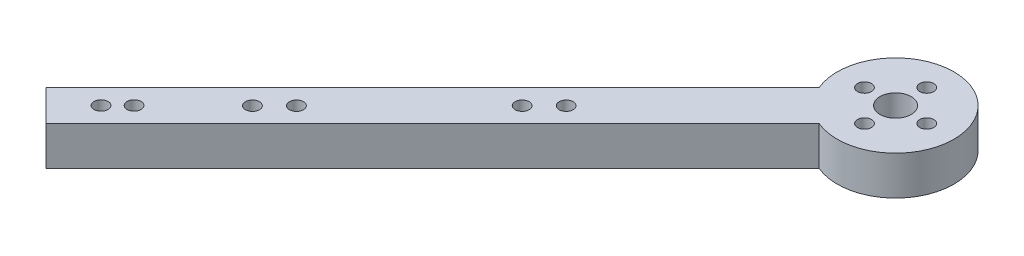
ISO-10303-21;
HEADER;
FILE_DESCRIPTION(('STEP AP214'),'2;1');
FILE_NAME('part.step','',(''),(''),'','','');
FILE_SCHEMA(('AUTOMOTIVE_DESIGN { 1 0 10303 214 1 1 1 1 }'));
ENDSEC;
DATA;
#1=APPLICATION_CONTEXT('core data for automotive mechanical design processes');
#2=APPLICATION_PROTOCOL_DEFINITION('international standard','automotive_design',2000,#1);
#3=PRODUCT_CONTEXT('',#1,'mechanical');
#4=PRODUCT('Part','Part','',(#3));
#5=PRODUCT_RELATED_PRODUCT_CATEGORY('part','',(#4));
#6=PRODUCT_DEFINITION_FORMATION('','',#4);
#7=PRODUCT_DEFINITION_CONTEXT('part definition',#1,'design');
#8=PRODUCT_DEFINITION('design','',#6,#7);
#9=PRODUCT_DEFINITION_SHAPE('','',#8);
#10=(LENGTH_UNIT() NAMED_UNIT(*) SI_UNIT(.MILLI.,.METRE.));
#11=(NAMED_UNIT(*) PLANE_ANGLE_UNIT() SI_UNIT($,.RADIAN.));
#12=(NAMED_UNIT(*) SI_UNIT($,.STERADIAN.) SOLID_ANGLE_UNIT());
#13=UNCERTAINTY_MEASURE_WITH_UNIT(LENGTH_MEASURE(1.E-05),#10,'distance_accuracy_value','');
#14=(GEOMETRIC_REPRESENTATION_CONTEXT(3) GLOBAL_UNCERTAINTY_ASSIGNED_CONTEXT((#13)) GLOBAL_UNIT_ASSIGNED_CONTEXT((#10,
#11,#12)) REPRESENTATION_CONTEXT('',''));
#15=CARTESIAN_POINT('',(0.,0.,0.));
#16=DIRECTION('',(0.,0.,1.));
#17=DIRECTION('',(1.,0.,0.));
#18=AXIS2_PLACEMENT_3D('',#15,#16,#17);
#19=CARTESIAN_POINT('',(0.,6.35,0.));
#20=DIRECTION('',(0.,-1.,0.));
#21=DIRECTION('',(0.,0.,-1.));
#22=AXIS2_PLACEMENT_3D('',#19,#20,#21);
#23=CYLINDRICAL_SURFACE('',#22,9.525);
#24=DIRECTION('',(0.,-1.,0.));
#25=VECTOR('',#24,1.);
#26=CARTESIAN_POINT('',(-8.77788525864336,6.35,3.69788525864331));
#27=LINE('',#26,#25);
#28=CARTESIAN_POINT('',(-8.77788525864337,6.35,3.69788525864331));
#29=VERTEX_POINT('',#28);
#30=CARTESIAN_POINT('',(-8.77788525864337,0.,3.69788525864331));
#31=VERTEX_POINT('',#30);
#32=EDGE_CURVE('E98',#29,#31,#27,.T.);
#33=ORIENTED_EDGE('',*,*,#32,.F.);
#34=CARTESIAN_POINT('',(0.,6.35,0.));
#35=DIRECTION('',(0.,1.,0.));
#36=DIRECTION('',(0.,0.,1.));
#37=AXIS2_PLACEMENT_3D('',#34,#35,#36);
#38=CIRCLE('',#37,9.525);
#39=CARTESIAN_POINT('',(-3.69788525864339,6.35,8.77788525864333));
#40=VERTEX_POINT('',#39);
#41=EDGE_CURVE('E11',#40,#29,#38,.T.);
#42=ORIENTED_EDGE('',*,*,#41,.F.);
#43=DIRECTION('',(0.,-1.,0.));
#44=VECTOR('',#43,1.);
#45=CARTESIAN_POINT('',(-3.69788525864339,6.35,8.77788525864333));
#46=LINE('',#45,#44);
#47=CARTESIAN_POINT('',(-3.69788525864339,0.,8.77788525864333));
#48=VERTEX_POINT('',#47);
#49=EDGE_CURVE('E107',#40,#48,#46,.T.);
#50=ORIENTED_EDGE('',*,*,#49,.T.);
#51=CARTESIAN_POINT('',(0.,0.,0.));
#52=DIRECTION('',(0.,1.,0.));
#53=DIRECTION('',(0.,0.,1.));
#54=AXIS2_PLACEMENT_3D('',#51,#52,#53);
#55=CIRCLE('',#54,9.525);
#56=EDGE_CURVE('E44',#48,#31,#55,.T.);
#57=ORIENTED_EDGE('',*,*,#56,.T.);
#58=EDGE_LOOP('',(#33,#42,#50,#57));
#59=FACE_BOUND('',#58,.T.);
#60=ADVANCED_FACE('F41',(#59),#23,.T.);
#61=CARTESIAN_POINT('',(0.,6.35,0.));
#62=DIRECTION('',(0.,1.,0.));
#63=DIRECTION('',(0.,0.,1.));
#64=AXIS2_PLACEMENT_3D('',#61,#62,#63);
#65=PLANE('',#64);
#66=CARTESIAN_POINT('',(-64.8210295257706,6.35,64.8028122902666));
#67=DIRECTION('',(0.,1.,0.));
#68=DIRECTION('',(0.,0.,1.));
#69=AXIS2_PLACEMENT_3D('',#66,#67,#68);
#70=CIRCLE('',#69,1.14300000000001);
#71=CARTESIAN_POINT('',(-64.8210295257706,6.35,65.9458122902666));
#72=VERTEX_POINT('',#71);
#73=EDGE_CURVE('E333',#72,#72,#70,.T.);
#74=ORIENTED_EDGE('',*,*,#73,.F.);
#75=EDGE_LOOP('',(#74));
#76=FACE_BOUND('',#75,.T.);
#77=CARTESIAN_POINT('',(-62.1269526894493,6.35,62.1087354539465));
#78=DIRECTION('',(0.,1.,0.));
#79=DIRECTION('',(0.,0.,1.));
#80=AXIS2_PLACEMENT_3D('',#77,#78,#79);
#81=CIRCLE('',#80,1.14299999999959);
#82=CARTESIAN_POINT('',(-62.1269526894493,6.35,63.2517354539461));
#83=VERTEX_POINT('',#82);
#84=EDGE_CURVE('E341',#83,#83,#81,.T.);
#85=ORIENTED_EDGE('',*,*,#84,.F.);
#86=EDGE_LOOP('',(#85));
#87=FACE_BOUND('',#86,.T.);
#88=CARTESIAN_POINT('',(-52.4386025927429,6.35,52.4896591649441));
#89=DIRECTION('',(0.,1.,0.));
#90=DIRECTION('',(0.,0.,1.));
#91=AXIS2_PLACEMENT_3D('',#88,#89,#90);
#92=CIRCLE('',#91,1.143);
#93=CARTESIAN_POINT('',(-52.4386025927429,6.35,53.6326591649441));
#94=VERTEX_POINT('',#93);
#95=EDGE_CURVE('E351',#94,#94,#92,.T.);
#96=ORIENTED_EDGE('',*,*,#95,.F.);
#97=EDGE_LOOP('',(#96));
#98=FACE_BOUND('',#97,.T.);
#99=CARTESIAN_POINT('',(-48.8465001443152,6.35,48.8975567165164));
#100=DIRECTION('',(0.,1.,0.));
#101=DIRECTION('',(0.,0.,1.));
#102=AXIS2_PLACEMENT_3D('',#99,#100,#101);
#103=CIRCLE('',#102,1.143);
#104=CARTESIAN_POINT('',(-48.8465001443152,6.35,50.0405567165164));
#105=VERTEX_POINT('',#104);
#106=EDGE_CURVE('E359',#105,#105,#103,.T.);
#107=ORIENTED_EDGE('',*,*,#106,.F.);
#108=EDGE_LOOP('',(#107));
#109=FACE_BOUND('',#108,.T.);
#110=CARTESIAN_POINT('',(-30.4369750961234,6.35,30.4880316683247));
#111=DIRECTION('',(0.,1.,0.));
#112=DIRECTION('',(0.,0.,1.));
#113=AXIS2_PLACEMENT_3D('',#110,#111,#112);
#114=CIRCLE('',#113,1.143);
#115=CARTESIAN_POINT('',(-30.4369750961234,6.35,31.6310316683247));
#116=VERTEX_POINT('',#115);
#117=EDGE_CURVE('E367',#116,#116,#114,.T.);
#118=ORIENTED_EDGE('',*,*,#117,.F.);
#119=EDGE_LOOP('',(#118));
#120=FACE_BOUND('',#119,.T.);
#121=CARTESIAN_POINT('',(-26.8448726476958,6.35,26.895929219897));
#122=DIRECTION('',(0.,1.,0.));
#123=DIRECTION('',(0.,0.,1.));
#124=AXIS2_PLACEMENT_3D('',#121,#122,#123);
#125=CIRCLE('',#124,1.143);
#126=CARTESIAN_POINT('',(-26.8448726476958,6.35,28.038929219897));
#127=VERTEX_POINT('',#126);
#128=EDGE_CURVE('E374',#127,#127,#125,.T.);
#129=ORIENTED_EDGE('',*,*,#128,.F.);
#130=EDGE_LOOP('',(#129));
#131=FACE_BOUND('',#130,.T.);
#132=CARTESIAN_POINT('',(5.08,6.35,0.));
#133=DIRECTION('',(0.,1.,0.));
#134=DIRECTION('',(0.,0.,1.));
#135=AXIS2_PLACEMENT_3D('',#132,#133,#134);
#136=CIRCLE('',#135,1.143);
#137=CARTESIAN_POINT('',(5.08,6.35,1.14300000000004));
#138=VERTEX_POINT('',#137);
#139=EDGE_CURVE('E135',#138,#138,#136,.T.);
#140=ORIENTED_EDGE('',*,*,#139,.F.);
#141=EDGE_LOOP('',(#140));
#142=FACE_BOUND('',#141,.T.);
#143=CARTESIAN_POINT('',(-5.08,6.35,0.));
#144=DIRECTION('',(0.,1.,0.));
#145=DIRECTION('',(0.,0.,1.));
#146=AXIS2_PLACEMENT_3D('',#143,#144,#145);
#147=CIRCLE('',#146,1.143);
#148=CARTESIAN_POINT('',(-5.08,6.35,1.143));
#149=VERTEX_POINT('',#148);
#150=EDGE_CURVE('E151',#149,#149,#147,.T.);
#151=ORIENTED_EDGE('',*,*,#150,.F.);
#152=EDGE_LOOP('',(#151));
#153=FACE_BOUND('',#152,.T.);
#154=ORIENTED_EDGE('',*,*,#41,.T.);
#155=DIRECTION('',(-0.70710678118655,0.,0.707106781186545));
#156=VECTOR('',#155,1.);
#157=CARTESIAN_POINT('',(-2.53999999999999,6.35,-2.54000000000001));
#158=LINE('',#157,#156);
#159=CARTESIAN_POINT('',(-71.8420489685535,6.35,66.7620489685529));
#160=VERTEX_POINT('',#159);
#161=EDGE_CURVE('E77',#29,#160,#158,.T.);
#162=ORIENTED_EDGE('',*,*,#161,.T.);
#163=DIRECTION('',(0.707106781186547,0.,0.707106781186549));
#164=VECTOR('',#163,1.);
#165=CARTESIAN_POINT('',(-69.3020489685533,6.35,69.3020489685532));
#166=LINE('',#165,#164);
#167=CARTESIAN_POINT('',(-66.7620489685536,6.35,71.8420489685529));
#168=VERTEX_POINT('',#167);
#169=EDGE_CURVE('E83',#160,#168,#166,.T.);
#170=ORIENTED_EDGE('',*,*,#169,.T.);
#171=DIRECTION('',(-0.707106781186551,0.,0.707106781186544));
#172=VECTOR('',#171,1.);
#173=CARTESIAN_POINT('',(2.53999999999999,6.35,2.54000000000002));
#174=LINE('',#173,#172);
#175=EDGE_CURVE('E104',#40,#168,#174,.T.);
#176=ORIENTED_EDGE('',*,*,#175,.F.);
#177=EDGE_LOOP('',(#154,#162,#170,#176));
#178=FACE_BOUND('',#177,.T.);
#179=CARTESIAN_POINT('',(0.,6.35,0.));
#180=DIRECTION('',(0.,1.,0.));
#181=DIRECTION('',(0.,0.,1.));
#182=AXIS2_PLACEMENT_3D('',#179,#180,#181);
#183=CIRCLE('',#182,2.54);
#184=CARTESIAN_POINT('',(0.,6.35,2.54));
#185=VERTEX_POINT('',#184);
#186=EDGE_CURVE('E159',#185,#185,#183,.T.);
#187=ORIENTED_EDGE('',*,*,#186,.F.);
#188=EDGE_LOOP('',(#187));
#189=FACE_BOUND('',#188,.T.);
#190=CARTESIAN_POINT('',(0.,6.35,-5.08));
#191=DIRECTION('',(0.,1.,0.));
#192=DIRECTION('',(0.,0.,1.));
#193=AXIS2_PLACEMENT_3D('',#190,#191,#192);
#194=CIRCLE('',#193,1.143);
#195=CARTESIAN_POINT('',(0.,6.35,-3.937));
#196=VERTEX_POINT('',#195);
#197=EDGE_CURVE('E143',#196,#196,#194,.T.);
#198=ORIENTED_EDGE('',*,*,#197,.F.);
#199=EDGE_LOOP('',(#198));
#200=FACE_BOUND('',#199,.T.);
#201=CARTESIAN_POINT('',(0.,6.35,5.08));
#202=DIRECTION('',(0.,1.,0.));
#203=DIRECTION('',(0.,0.,1.));
#204=AXIS2_PLACEMENT_3D('',#201,#202,#203);
#205=CIRCLE('',#204,1.143);
#206=CARTESIAN_POINT('',(0.,6.35,6.223));
#207=VERTEX_POINT('',#206);
#208=EDGE_CURVE('E127',#207,#207,#205,.T.);
#209=ORIENTED_EDGE('',*,*,#208,.F.);
#210=EDGE_LOOP('',(#209));
#211=FACE_BOUND('',#210,.T.);
#212=ADVANCED_FACE('F79',(#76,#87,#98,#109,#120,#131,#142,#153,#178,#189,#200,#211),#65,.T.);
#213=CARTESIAN_POINT('',(0.,0.,0.));
#214=DIRECTION('',(0.,1.,0.));
#215=DIRECTION('',(0.,0.,1.));
#216=AXIS2_PLACEMENT_3D('',#213,#214,#215);
#217=PLANE('',#216);
#218=CARTESIAN_POINT('',(-64.8210295257706,0.,64.8028122902666));
#219=DIRECTION('',(0.,1.,0.));
#220=DIRECTION('',(0.,0.,1.));
#221=AXIS2_PLACEMENT_3D('',#218,#219,#220);
#222=CIRCLE('',#221,1.14300000000001);
#223=CARTESIAN_POINT('',(-64.8210295257706,0.,65.9458122902666));
#224=VERTEX_POINT('',#223);
#225=EDGE_CURVE('E114',#224,#224,#222,.T.);
#226=ORIENTED_EDGE('',*,*,#225,.T.);
#227=EDGE_LOOP('',(#226));
#228=FACE_BOUND('',#227,.T.);
#229=CARTESIAN_POINT('',(-62.1269526894493,0.,62.1087354539465));
#230=DIRECTION('',(0.,1.,0.));
#231=DIRECTION('',(0.,0.,1.));
#232=AXIS2_PLACEMENT_3D('',#229,#230,#231);
#233=CIRCLE('',#232,1.14299999999959);
#234=CARTESIAN_POINT('',(-62.1269526894493,0.,63.2517354539461));
#235=VERTEX_POINT('',#234);
#236=EDGE_CURVE('E335',#235,#235,#233,.T.);
#237=ORIENTED_EDGE('',*,*,#236,.T.);
#238=EDGE_LOOP('',(#237));
#239=FACE_BOUND('',#238,.T.);
#240=CARTESIAN_POINT('',(-52.4386025927429,0.,52.4896591649441));
#241=DIRECTION('',(0.,1.,0.));
#242=DIRECTION('',(0.,0.,1.));
#243=AXIS2_PLACEMENT_3D('',#240,#241,#242);
#244=CIRCLE('',#243,1.143);
#245=CARTESIAN_POINT('',(-52.4386025927429,0.,53.6326591649441));
#246=VERTEX_POINT('',#245);
#247=EDGE_CURVE('E347',#246,#246,#244,.T.);
#248=ORIENTED_EDGE('',*,*,#247,.T.);
#249=EDGE_LOOP('',(#248));
#250=FACE_BOUND('',#249,.T.);
#251=CARTESIAN_POINT('',(-48.8465001443152,0.,48.8975567165164));
#252=DIRECTION('',(0.,1.,0.));
#253=DIRECTION('',(0.,0.,1.));
#254=AXIS2_PLACEMENT_3D('',#251,#252,#253);
#255=CIRCLE('',#254,1.143);
#256=CARTESIAN_POINT('',(-48.8465001443152,0.,50.0405567165164));
#257=VERTEX_POINT('',#256);
#258=EDGE_CURVE('E355',#257,#257,#255,.T.);
#259=ORIENTED_EDGE('',*,*,#258,.T.);
#260=EDGE_LOOP('',(#259));
#261=FACE_BOUND('',#260,.T.);
#262=CARTESIAN_POINT('',(-30.4369750961234,0.,30.4880316683247));
#263=DIRECTION('',(0.,1.,0.));
#264=DIRECTION('',(0.,0.,1.));
#265=AXIS2_PLACEMENT_3D('',#262,#263,#264);
#266=CIRCLE('',#265,1.143);
#267=CARTESIAN_POINT('',(-30.4369750961234,0.,31.6310316683247));
#268=VERTEX_POINT('',#267);
#269=EDGE_CURVE('E363',#268,#268,#266,.T.);
#270=ORIENTED_EDGE('',*,*,#269,.T.);
#271=EDGE_LOOP('',(#270));
#272=FACE_BOUND('',#271,.T.);
#273=CARTESIAN_POINT('',(-26.8448726476958,0.,26.895929219897));
#274=DIRECTION('',(0.,1.,0.));
#275=DIRECTION('',(0.,0.,1.));
#276=AXIS2_PLACEMENT_3D('',#273,#274,#275);
#277=CIRCLE('',#276,1.143);
#278=CARTESIAN_POINT('',(-26.8448726476958,0.,28.038929219897));
#279=VERTEX_POINT('',#278);
#280=EDGE_CURVE('E371',#279,#279,#277,.T.);
#281=ORIENTED_EDGE('',*,*,#280,.T.);
#282=EDGE_LOOP('',(#281));
#283=FACE_BOUND('',#282,.T.);
#284=ORIENTED_EDGE('',*,*,#56,.F.);
#285=DIRECTION('',(-0.707106781186551,0.,0.707106781186544));
#286=VECTOR('',#285,1.);
#287=CARTESIAN_POINT('',(2.53999999999999,0.,2.54000000000002));
#288=LINE('',#287,#286);
#289=CARTESIAN_POINT('',(-66.7620489685536,0.,71.8420489685529));
#290=VERTEX_POINT('',#289);
#291=EDGE_CURVE('E87',#48,#290,#288,.T.);
#292=ORIENTED_EDGE('',*,*,#291,.T.);
#293=DIRECTION('',(0.707106781186547,0.,0.707106781186549));
#294=VECTOR('',#293,1.);
#295=CARTESIAN_POINT('',(-69.3020489685533,0.,69.3020489685532));
#296=LINE('',#295,#294);
#297=CARTESIAN_POINT('',(-71.8420489685535,0.,66.7620489685529));
#298=VERTEX_POINT('',#297);
#299=EDGE_CURVE('E113',#298,#290,#296,.T.);
#300=ORIENTED_EDGE('',*,*,#299,.F.);
#301=DIRECTION('',(-0.70710678118655,0.,0.707106781186545));
#302=VECTOR('',#301,1.);
#303=CARTESIAN_POINT('',(-2.53999999999999,0.,-2.54000000000001));
#304=LINE('',#303,#302);
#305=EDGE_CURVE('E93',#31,#298,#304,.T.);
#306=ORIENTED_EDGE('',*,*,#305,.F.);
#307=EDGE_LOOP('',(#284,#292,#300,#306));
#308=FACE_BOUND('',#307,.T.);
#309=CARTESIAN_POINT('',(0.,0.,0.));
#310=DIRECTION('',(0.,1.,0.));
#311=DIRECTION('',(0.,0.,1.));
#312=AXIS2_PLACEMENT_3D('',#309,#310,#311);
#313=CIRCLE('',#312,2.54);
#314=CARTESIAN_POINT('',(0.,0.,2.54));
#315=VERTEX_POINT('',#314);
#316=EDGE_CURVE('E155',#315,#315,#313,.T.);
#317=ORIENTED_EDGE('',*,*,#316,.T.);
#318=EDGE_LOOP('',(#317));
#319=FACE_BOUND('',#318,.T.);
#320=CARTESIAN_POINT('',(-5.08,0.,0.));
#321=DIRECTION('',(0.,1.,0.));
#322=DIRECTION('',(0.,0.,1.));
#323=AXIS2_PLACEMENT_3D('',#320,#321,#322);
#324=CIRCLE('',#323,1.143);
#325=CARTESIAN_POINT('',(-5.08,0.,1.143));
#326=VERTEX_POINT('',#325);
#327=EDGE_CURVE('E147',#326,#326,#324,.T.);
#328=ORIENTED_EDGE('',*,*,#327,.T.);
#329=EDGE_LOOP('',(#328));
#330=FACE_BOUND('',#329,.T.);
#331=CARTESIAN_POINT('',(0.,0.,-5.08));
#332=DIRECTION('',(0.,1.,0.));
#333=DIRECTION('',(0.,0.,1.));
#334=AXIS2_PLACEMENT_3D('',#331,#332,#333);
#335=CIRCLE('',#334,1.143);
#336=CARTESIAN_POINT('',(0.,0.,-3.937));
#337=VERTEX_POINT('',#336);
#338=EDGE_CURVE('E139',#337,#337,#335,.T.);
#339=ORIENTED_EDGE('',*,*,#338,.T.);
#340=EDGE_LOOP('',(#339));
#341=FACE_BOUND('',#340,.T.);
#342=CARTESIAN_POINT('',(5.08,0.,0.));
#343=DIRECTION('',(0.,1.,0.));
#344=DIRECTION('',(0.,0.,1.));
#345=AXIS2_PLACEMENT_3D('',#342,#343,#344);
#346=CIRCLE('',#345,1.143);
#347=CARTESIAN_POINT('',(5.08,0.,1.14300000000004));
#348=VERTEX_POINT('',#347);
#349=EDGE_CURVE('E131',#348,#348,#346,.T.);
#350=ORIENTED_EDGE('',*,*,#349,.T.);
#351=EDGE_LOOP('',(#350));
#352=FACE_BOUND('',#351,.T.);
#353=CARTESIAN_POINT('',(0.,0.,5.08));
#354=DIRECTION('',(0.,1.,0.));
#355=DIRECTION('',(0.,0.,1.));
#356=AXIS2_PLACEMENT_3D('',#353,#354,#355);
#357=CIRCLE('',#356,1.143);
#358=CARTESIAN_POINT('',(0.,0.,6.223));
#359=VERTEX_POINT('',#358);
#360=EDGE_CURVE('E126',#359,#359,#357,.T.);
#361=ORIENTED_EDGE('',*,*,#360,.T.);
#362=EDGE_LOOP('',(#361));
#363=FACE_BOUND('',#362,.T.);
#364=ADVANCED_FACE('F167',(#228,#239,#250,#261,#272,#283,#308,#319,#330,#341,#352,#363),#217,.F.);
#365=CARTESIAN_POINT('',(0.,6.35,0.));
#366=DIRECTION('',(0.,-1.,0.));
#367=DIRECTION('',(0.,0.,-1.));
#368=AXIS2_PLACEMENT_3D('',#365,#366,#367);
#369=CYLINDRICAL_SURFACE('',#368,2.54);
#370=ORIENTED_EDGE('',*,*,#186,.T.);
#371=EDGE_LOOP('',(#370));
#372=FACE_BOUND('',#371,.T.);
#373=ORIENTED_EDGE('',*,*,#316,.F.);
#374=EDGE_LOOP('',(#373));
#375=FACE_BOUND('',#374,.T.);
#376=ADVANCED_FACE('F170',(#372,#375),#369,.F.);
#377=CARTESIAN_POINT('',(-5.08,6.35,0.));
#378=DIRECTION('',(0.,-1.,0.));
#379=DIRECTION('',(0.,0.,-1.));
#380=AXIS2_PLACEMENT_3D('',#377,#378,#379);
#381=CYLINDRICAL_SURFACE('',#380,1.143);
#382=ORIENTED_EDGE('',*,*,#150,.T.);
#383=EDGE_LOOP('',(#382));
#384=FACE_BOUND('',#383,.T.);
#385=ORIENTED_EDGE('',*,*,#327,.F.);
#386=EDGE_LOOP('',(#385));
#387=FACE_BOUND('',#386,.T.);
#388=ADVANCED_FACE('F172',(#384,#387),#381,.F.);
#389=CARTESIAN_POINT('',(0.,6.35,-5.08));
#390=DIRECTION('',(0.,-1.,0.));
#391=DIRECTION('',(0.,0.,-1.));
#392=AXIS2_PLACEMENT_3D('',#389,#390,#391);
#393=CYLINDRICAL_SURFACE('',#392,1.143);
#394=ORIENTED_EDGE('',*,*,#197,.T.);
#395=EDGE_LOOP('',(#394));
#396=FACE_BOUND('',#395,.T.);
#397=ORIENTED_EDGE('',*,*,#338,.F.);
#398=EDGE_LOOP('',(#397));
#399=FACE_BOUND('',#398,.T.);
#400=ADVANCED_FACE('F179',(#396,#399),#393,.F.);
#401=CARTESIAN_POINT('',(5.08,6.35,0.));
#402=DIRECTION('',(0.,-1.,0.));
#403=DIRECTION('',(0.,0.,-1.));
#404=AXIS2_PLACEMENT_3D('',#401,#402,#403);
#405=CYLINDRICAL_SURFACE('',#404,1.143);
#406=ORIENTED_EDGE('',*,*,#139,.T.);
#407=EDGE_LOOP('',(#406));
#408=FACE_BOUND('',#407,.T.);
#409=ORIENTED_EDGE('',*,*,#349,.F.);
#410=EDGE_LOOP('',(#409));
#411=FACE_BOUND('',#410,.T.);
#412=ADVANCED_FACE('F211',(#408,#411),#405,.F.);
#413=CARTESIAN_POINT('',(0.,6.35,5.08));
#414=DIRECTION('',(0.,-1.,0.));
#415=DIRECTION('',(0.,0.,-1.));
#416=AXIS2_PLACEMENT_3D('',#413,#414,#415);
#417=CYLINDRICAL_SURFACE('',#416,1.143);
#418=ORIENTED_EDGE('',*,*,#208,.T.);
#419=EDGE_LOOP('',(#418));
#420=FACE_BOUND('',#419,.T.);
#421=ORIENTED_EDGE('',*,*,#360,.F.);
#422=EDGE_LOOP('',(#421));
#423=FACE_BOUND('',#422,.T.);
#424=ADVANCED_FACE('F208',(#420,#423),#417,.F.);
#425=CARTESIAN_POINT('',(-2.53999999999999,6.35,-2.54000000000001));
#426=DIRECTION('',(0.707106781186545,0.,0.70710678118655));
#427=DIRECTION('',(0.70710678118655,0.,-0.707106781186545));
#428=AXIS2_PLACEMENT_3D('',#425,#426,#427);
#429=PLANE('',#428);
#430=ORIENTED_EDGE('',*,*,#305,.T.);
#431=DIRECTION('',(0.,-1.,0.));
#432=VECTOR('',#431,1.);
#433=CARTESIAN_POINT('',(-71.8420489685535,6.35,66.7620489685529));
#434=LINE('',#433,#432);
#435=EDGE_CURVE('E90',#160,#298,#434,.T.);
#436=ORIENTED_EDGE('',*,*,#435,.F.);
#437=ORIENTED_EDGE('',*,*,#161,.F.);
#438=ORIENTED_EDGE('',*,*,#32,.T.);
#439=EDGE_LOOP('',(#430,#436,#437,#438));
#440=FACE_BOUND('',#439,.T.);
#441=ADVANCED_FACE('F91',(#440),#429,.F.);
#442=CARTESIAN_POINT('',(-69.3020489685533,6.35,69.3020489685532));
#443=DIRECTION('',(0.707106781186548,0.,-0.707106781186547));
#444=DIRECTION('',(-0.707106781186547,0.,-0.707106781186548));
#445=AXIS2_PLACEMENT_3D('',#442,#443,#444);
#446=PLANE('',#445);
#447=ORIENTED_EDGE('',*,*,#299,.T.);
#448=DIRECTION('',(0.,-1.,0.));
#449=VECTOR('',#448,1.);
#450=CARTESIAN_POINT('',(-66.7620489685536,6.35,71.8420489685529));
#451=LINE('',#450,#449);
#452=EDGE_CURVE('E99',#168,#290,#451,.T.);
#453=ORIENTED_EDGE('',*,*,#452,.F.);
#454=ORIENTED_EDGE('',*,*,#169,.F.);
#455=ORIENTED_EDGE('',*,*,#435,.T.);
#456=EDGE_LOOP('',(#447,#453,#454,#455));
#457=FACE_BOUND('',#456,.T.);
#458=ADVANCED_FACE('F101',(#457),#446,.F.);
#459=CARTESIAN_POINT('',(2.53999999999999,6.35,2.54000000000002));
#460=DIRECTION('',(0.707106781186544,0.,0.707106781186551));
#461=DIRECTION('',(0.707106781186551,0.,-0.707106781186544));
#462=AXIS2_PLACEMENT_3D('',#459,#460,#461);
#463=PLANE('',#462);
#464=ORIENTED_EDGE('',*,*,#291,.F.);
#465=ORIENTED_EDGE('',*,*,#49,.F.);
#466=ORIENTED_EDGE('',*,*,#175,.T.);
#467=ORIENTED_EDGE('',*,*,#452,.T.);
#468=EDGE_LOOP('',(#464,#465,#466,#467));
#469=FACE_BOUND('',#468,.T.);
#470=ADVANCED_FACE('F192',(#469),#463,.T.);
#471=CARTESIAN_POINT('',(-26.8448726476958,0.,26.895929219897));
#472=DIRECTION('',(0.,1.,0.));
#473=DIRECTION('',(0.,0.,1.));
#474=AXIS2_PLACEMENT_3D('',#471,#472,#473);
#475=CYLINDRICAL_SURFACE('',#474,1.143);
#476=ORIENTED_EDGE('',*,*,#280,.F.);
#477=EDGE_LOOP('',(#476));
#478=FACE_BOUND('',#477,.T.);
#479=ORIENTED_EDGE('',*,*,#128,.T.);
#480=EDGE_LOOP('',(#479));
#481=FACE_BOUND('',#480,.T.);
#482=ADVANCED_FACE('F194',(#478,#481),#475,.F.);
#483=CARTESIAN_POINT('',(-30.4369750961234,0.,30.4880316683247));
#484=DIRECTION('',(0.,1.,0.));
#485=DIRECTION('',(0.,0.,1.));
#486=AXIS2_PLACEMENT_3D('',#483,#484,#485);
#487=CYLINDRICAL_SURFACE('',#486,1.143);
#488=ORIENTED_EDGE('',*,*,#269,.F.);
#489=EDGE_LOOP('',(#488));
#490=FACE_BOUND('',#489,.T.);
#491=ORIENTED_EDGE('',*,*,#117,.T.);
#492=EDGE_LOOP('',(#491));
#493=FACE_BOUND('',#492,.T.);
#494=ADVANCED_FACE('F200',(#490,#493),#487,.F.);
#495=CARTESIAN_POINT('',(-48.8465001443152,0.,48.8975567165164));
#496=DIRECTION('',(0.,1.,0.));
#497=DIRECTION('',(0.,0.,1.));
#498=AXIS2_PLACEMENT_3D('',#495,#496,#497);
#499=CYLINDRICAL_SURFACE('',#498,1.143);
#500=ORIENTED_EDGE('',*,*,#258,.F.);
#501=EDGE_LOOP('',(#500));
#502=FACE_BOUND('',#501,.T.);
#503=ORIENTED_EDGE('',*,*,#106,.T.);
#504=EDGE_LOOP('',(#503));
#505=FACE_BOUND('',#504,.T.);
#506=ADVANCED_FACE('F285',(#502,#505),#499,.F.);
#507=CARTESIAN_POINT('',(-52.4386025927429,0.,52.4896591649441));
#508=DIRECTION('',(0.,1.,0.));
#509=DIRECTION('',(0.,0.,1.));
#510=AXIS2_PLACEMENT_3D('',#507,#508,#509);
#511=CYLINDRICAL_SURFACE('',#510,1.143);
#512=ORIENTED_EDGE('',*,*,#247,.F.);
#513=EDGE_LOOP('',(#512));
#514=FACE_BOUND('',#513,.T.);
#515=ORIENTED_EDGE('',*,*,#95,.T.);
#516=EDGE_LOOP('',(#515));
#517=FACE_BOUND('',#516,.T.);
#518=ADVANCED_FACE('F294',(#514,#517),#511,.F.);
#519=CARTESIAN_POINT('',(-62.1269526894493,0.,62.1087354539465));
#520=DIRECTION('',(0.,1.,0.));
#521=DIRECTION('',(0.,0.,1.));
#522=AXIS2_PLACEMENT_3D('',#519,#520,#521);
#523=CYLINDRICAL_SURFACE('',#522,1.14299999999959);
#524=ORIENTED_EDGE('',*,*,#236,.F.);
#525=EDGE_LOOP('',(#524));
#526=FACE_BOUND('',#525,.T.);
#527=ORIENTED_EDGE('',*,*,#84,.T.);
#528=EDGE_LOOP('',(#527));
#529=FACE_BOUND('',#528,.T.);
#530=ADVANCED_FACE('F304',(#526,#529),#523,.F.);
#531=CARTESIAN_POINT('',(-64.8210295257706,0.,64.8028122902666));
#532=DIRECTION('',(0.,1.,0.));
#533=DIRECTION('',(0.,0.,1.));
#534=AXIS2_PLACEMENT_3D('',#531,#532,#533);
#535=CYLINDRICAL_SURFACE('',#534,1.14300000000001);
#536=ORIENTED_EDGE('',*,*,#225,.F.);
#537=EDGE_LOOP('',(#536));
#538=FACE_BOUND('',#537,.T.);
#539=ORIENTED_EDGE('',*,*,#73,.T.);
#540=EDGE_LOOP('',(#539));
#541=FACE_BOUND('',#540,.T.);
#542=ADVANCED_FACE('F314',(#538,#541),#535,.F.);
#543=CLOSED_SHELL('',(#60,#212,#364,#376,#388,#400,#412,#424,#441,#458,#470,#482,#494,#506,#518,
#530,#542));
#544=MANIFOLD_SOLID_BREP('B2',#543);
#545=ADVANCED_BREP_SHAPE_REPRESENTATION('',(#18,#544),#14);
#546=SHAPE_DEFINITION_REPRESENTATION(#9,#545);
ENDSEC;
END-ISO-10303-21;
